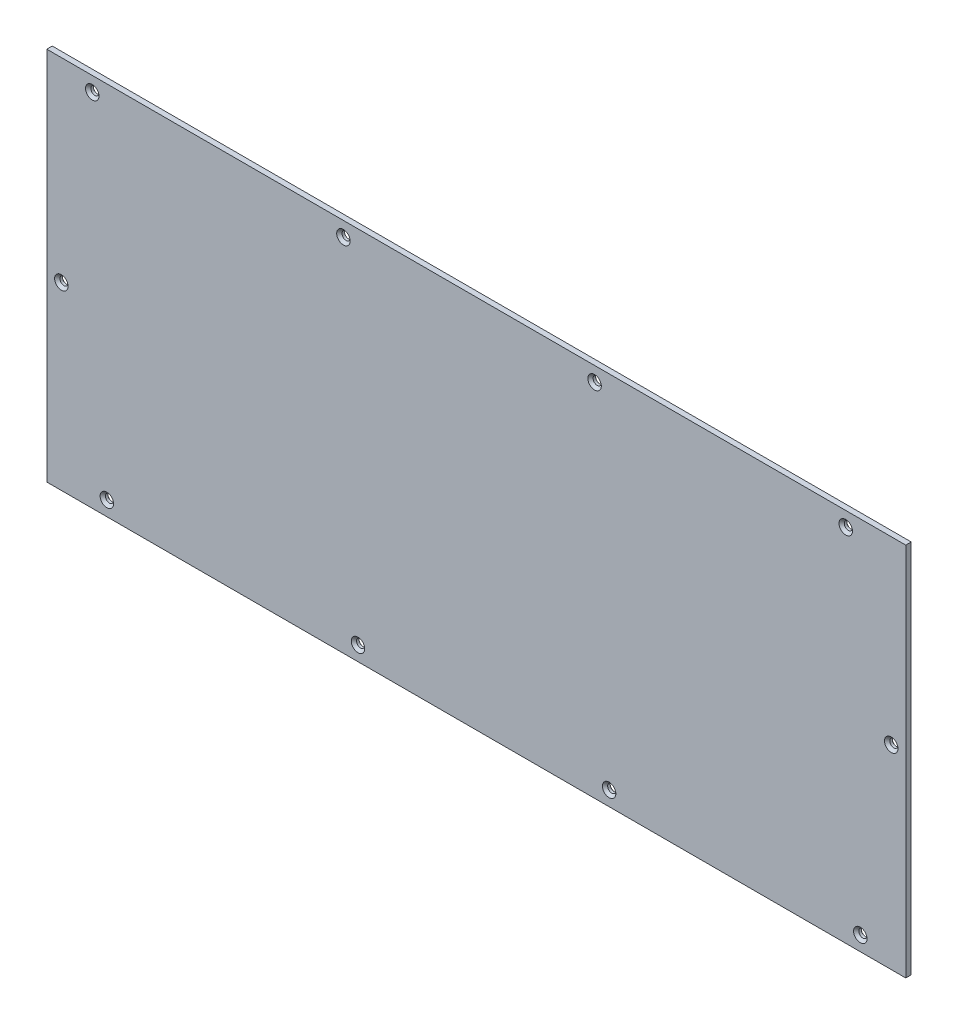
ISO-10303-21;
HEADER;
FILE_DESCRIPTION(('STEP AP214'),'2;1');
FILE_NAME('part.step','',(''),(''),'','','');
FILE_SCHEMA(('AUTOMOTIVE_DESIGN { 1 0 10303 214 1 1 1 1 }'));
ENDSEC;
DATA;
#1=APPLICATION_CONTEXT('core data for automotive mechanical design processes');
#2=APPLICATION_PROTOCOL_DEFINITION('international standard','automotive_design',2000,#1);
#3=PRODUCT_CONTEXT('',#1,'mechanical');
#4=PRODUCT('Part','Part','',(#3));
#5=PRODUCT_RELATED_PRODUCT_CATEGORY('part','',(#4));
#6=PRODUCT_DEFINITION_FORMATION('','',#4);
#7=PRODUCT_DEFINITION_CONTEXT('part definition',#1,'design');
#8=PRODUCT_DEFINITION('design','',#6,#7);
#9=PRODUCT_DEFINITION_SHAPE('','',#8);
#10=(LENGTH_UNIT() NAMED_UNIT(*) SI_UNIT(.MILLI.,.METRE.));
#11=(NAMED_UNIT(*) PLANE_ANGLE_UNIT() SI_UNIT($,.RADIAN.));
#12=(NAMED_UNIT(*) SI_UNIT($,.STERADIAN.) SOLID_ANGLE_UNIT());
#13=UNCERTAINTY_MEASURE_WITH_UNIT(LENGTH_MEASURE(1.E-05),#10,'distance_accuracy_value','');
#14=(GEOMETRIC_REPRESENTATION_CONTEXT(3) GLOBAL_UNCERTAINTY_ASSIGNED_CONTEXT((#13)) GLOBAL_UNIT_ASSIGNED_CONTEXT((#10,
#11,#12)) REPRESENTATION_CONTEXT('',''));
#15=CARTESIAN_POINT('',(0.,0.,0.));
#16=DIRECTION('',(0.,0.,1.));
#17=DIRECTION('',(1.,0.,0.));
#18=AXIS2_PLACEMENT_3D('',#15,#16,#17);
#19=CARTESIAN_POINT('',(0.,0.,3.));
#20=DIRECTION('',(1.,0.,0.));
#21=DIRECTION('',(0.,0.,-1.));
#22=AXIS2_PLACEMENT_3D('',#19,#20,#21);
#23=PLANE('',#22);
#24=DIRECTION('',(0.,-1.,0.));
#25=VECTOR('',#24,1.);
#26=CARTESIAN_POINT('',(0.,0.,0.));
#27=LINE('',#26,#25);
#28=CARTESIAN_POINT('',(0.,206.,0.));
#29=VERTEX_POINT('',#28);
#30=CARTESIAN_POINT('',(0.,0.,0.));
#31=VERTEX_POINT('',#30);
#32=EDGE_CURVE('E94',#29,#31,#27,.T.);
#33=ORIENTED_EDGE('',*,*,#32,.T.);
#34=DIRECTION('',(0.,0.,-1.));
#35=VECTOR('',#34,1.);
#36=CARTESIAN_POINT('',(0.,0.,3.));
#37=LINE('',#36,#35);
#38=CARTESIAN_POINT('',(0.,0.,3.));
#39=VERTEX_POINT('',#38);
#40=EDGE_CURVE('E11',#39,#31,#37,.T.);
#41=ORIENTED_EDGE('',*,*,#40,.F.);
#42=DIRECTION('',(0.,-1.,0.));
#43=VECTOR('',#42,1.);
#44=CARTESIAN_POINT('',(0.,0.,3.));
#45=LINE('',#44,#43);
#46=CARTESIAN_POINT('',(0.,206.,3.));
#47=VERTEX_POINT('',#46);
#48=EDGE_CURVE('E82',#47,#39,#45,.T.);
#49=ORIENTED_EDGE('',*,*,#48,.F.);
#50=DIRECTION('',(0.,0.,-1.));
#51=VECTOR('',#50,1.);
#52=CARTESIAN_POINT('',(0.,206.,3.));
#53=LINE('',#52,#51);
#54=EDGE_CURVE('E90',#47,#29,#53,.T.);
#55=ORIENTED_EDGE('',*,*,#54,.T.);
#56=EDGE_LOOP('',(#33,#41,#49,#55));
#57=FACE_BOUND('',#56,.T.);
#58=ADVANCED_FACE('F31',(#57),#23,.F.);
#59=CARTESIAN_POINT('',(0.,0.,3.));
#60=DIRECTION('',(0.,1.,0.));
#61=DIRECTION('',(0.,0.,1.));
#62=AXIS2_PLACEMENT_3D('',#59,#60,#61);
#63=PLANE('',#62);
#64=DIRECTION('',(1.,0.,0.));
#65=VECTOR('',#64,1.);
#66=CARTESIAN_POINT('',(0.,0.,0.));
#67=LINE('',#66,#65);
#68=CARTESIAN_POINT('',(472.,0.,0.));
#69=VERTEX_POINT('',#68);
#70=EDGE_CURVE('E86',#31,#69,#67,.T.);
#71=ORIENTED_EDGE('',*,*,#70,.T.);
#72=DIRECTION('',(0.,0.,-1.));
#73=VECTOR('',#72,1.);
#74=CARTESIAN_POINT('',(472.,0.,3.));
#75=LINE('',#74,#73);
#76=CARTESIAN_POINT('',(472.,0.,3.));
#77=VERTEX_POINT('',#76);
#78=EDGE_CURVE('E39',#77,#69,#75,.T.);
#79=ORIENTED_EDGE('',*,*,#78,.F.);
#80=DIRECTION('',(1.,0.,0.));
#81=VECTOR('',#80,1.);
#82=CARTESIAN_POINT('',(0.,0.,3.));
#83=LINE('',#82,#81);
#84=EDGE_CURVE('E77',#39,#77,#83,.T.);
#85=ORIENTED_EDGE('',*,*,#84,.F.);
#86=ORIENTED_EDGE('',*,*,#40,.T.);
#87=EDGE_LOOP('',(#71,#79,#85,#86));
#88=FACE_BOUND('',#87,.T.);
#89=ADVANCED_FACE('F85',(#88),#63,.F.);
#90=CARTESIAN_POINT('',(472.,0.,3.));
#91=DIRECTION('',(-1.,0.,0.));
#92=DIRECTION('',(0.,0.,1.));
#93=AXIS2_PLACEMENT_3D('',#90,#91,#92);
#94=PLANE('',#93);
#95=DIRECTION('',(0.,1.,0.));
#96=VECTOR('',#95,1.);
#97=CARTESIAN_POINT('',(472.,0.,0.));
#98=LINE('',#97,#96);
#99=CARTESIAN_POINT('',(472.,206.,0.));
#100=VERTEX_POINT('',#99);
#101=EDGE_CURVE('E64',#69,#100,#98,.T.);
#102=ORIENTED_EDGE('',*,*,#101,.T.);
#103=DIRECTION('',(0.,0.,-1.));
#104=VECTOR('',#103,1.);
#105=CARTESIAN_POINT('',(472.,206.,3.));
#106=LINE('',#105,#104);
#107=CARTESIAN_POINT('',(472.,206.,3.));
#108=VERTEX_POINT('',#107);
#109=EDGE_CURVE('E87',#108,#100,#106,.T.);
#110=ORIENTED_EDGE('',*,*,#109,.F.);
#111=DIRECTION('',(0.,1.,0.));
#112=VECTOR('',#111,1.);
#113=CARTESIAN_POINT('',(472.,0.,3.));
#114=LINE('',#113,#112);
#115=EDGE_CURVE('E80',#77,#108,#114,.T.);
#116=ORIENTED_EDGE('',*,*,#115,.F.);
#117=ORIENTED_EDGE('',*,*,#78,.T.);
#118=EDGE_LOOP('',(#102,#110,#116,#117));
#119=FACE_BOUND('',#118,.T.);
#120=ADVANCED_FACE('F88',(#119),#94,.F.);
#121=CARTESIAN_POINT('',(0.,206.,3.));
#122=DIRECTION('',(0.,-1.,0.));
#123=DIRECTION('',(0.,0.,-1.));
#124=AXIS2_PLACEMENT_3D('',#121,#122,#123);
#125=PLANE('',#124);
#126=DIRECTION('',(-1.,0.,0.));
#127=VECTOR('',#126,1.);
#128=CARTESIAN_POINT('',(0.,206.,0.));
#129=LINE('',#128,#127);
#130=EDGE_CURVE('E70',#100,#29,#129,.T.);
#131=ORIENTED_EDGE('',*,*,#130,.T.);
#132=ORIENTED_EDGE('',*,*,#54,.F.);
#133=DIRECTION('',(-1.,0.,0.));
#134=VECTOR('',#133,1.);
#135=CARTESIAN_POINT('',(0.,206.,3.));
#136=LINE('',#135,#134);
#137=EDGE_CURVE('E47',#108,#47,#136,.T.);
#138=ORIENTED_EDGE('',*,*,#137,.F.);
#139=ORIENTED_EDGE('',*,*,#109,.T.);
#140=EDGE_LOOP('',(#131,#132,#138,#139));
#141=FACE_BOUND('',#140,.T.);
#142=ADVANCED_FACE('F102',(#141),#125,.F.);
#143=CARTESIAN_POINT('',(0.,206.,3.));
#144=DIRECTION('',(0.,0.,-1.));
#145=DIRECTION('',(-1.,0.,0.));
#146=AXIS2_PLACEMENT_3D('',#143,#144,#145);
#147=PLANE('',#146);
#148=CARTESIAN_POINT('',(25.,198.,3.));
#149=DIRECTION('',(0.,0.,1.));
#150=DIRECTION('',(1.,0.,0.));
#151=AXIS2_PLACEMENT_3D('',#148,#149,#150);
#152=CIRCLE('',#151,3.7);
#153=CARTESIAN_POINT('',(28.7,198.,3.));
#154=VERTEX_POINT('',#153);
#155=EDGE_CURVE('E221',#154,#154,#152,.T.);
#156=ORIENTED_EDGE('',*,*,#155,.F.);
#157=EDGE_LOOP('',(#156));
#158=FACE_BOUND('',#157,.T.);
#159=CARTESIAN_POINT('',(163.,198.,3.));
#160=DIRECTION('',(0.,0.,1.));
#161=DIRECTION('',(1.,0.,0.));
#162=AXIS2_PLACEMENT_3D('',#159,#160,#161);
#163=CIRCLE('',#162,3.70000000000001);
#164=CARTESIAN_POINT('',(166.7,198.,3.));
#165=VERTEX_POINT('',#164);
#166=EDGE_CURVE('E209',#165,#165,#163,.T.);
#167=ORIENTED_EDGE('',*,*,#166,.F.);
#168=EDGE_LOOP('',(#167));
#169=FACE_BOUND('',#168,.T.);
#170=CARTESIAN_POINT('',(301.,198.,3.));
#171=DIRECTION('',(0.,0.,1.));
#172=DIRECTION('',(1.,0.,0.));
#173=AXIS2_PLACEMENT_3D('',#170,#171,#172);
#174=CIRCLE('',#173,3.69999999999998);
#175=CARTESIAN_POINT('',(304.7,198.,3.));
#176=VERTEX_POINT('',#175);
#177=EDGE_CURVE('E197',#176,#176,#174,.T.);
#178=ORIENTED_EDGE('',*,*,#177,.F.);
#179=EDGE_LOOP('',(#178));
#180=FACE_BOUND('',#179,.T.);
#181=CARTESIAN_POINT('',(439.,198.,3.));
#182=DIRECTION('',(0.,0.,1.));
#183=DIRECTION('',(1.,0.,0.));
#184=AXIS2_PLACEMENT_3D('',#181,#182,#183);
#185=CIRCLE('',#184,3.69999999999998);
#186=CARTESIAN_POINT('',(442.7,198.,3.));
#187=VERTEX_POINT('',#186);
#188=EDGE_CURVE('E185',#187,#187,#185,.T.);
#189=ORIENTED_EDGE('',*,*,#188,.F.);
#190=EDGE_LOOP('',(#189));
#191=FACE_BOUND('',#190,.T.);
#192=CARTESIAN_POINT('',(447.,8.,3.));
#193=DIRECTION('',(0.,0.,1.));
#194=DIRECTION('',(1.,0.,0.));
#195=AXIS2_PLACEMENT_3D('',#192,#193,#194);
#196=CIRCLE('',#195,3.69999999999998);
#197=CARTESIAN_POINT('',(450.7,8.,3.));
#198=VERTEX_POINT('',#197);
#199=EDGE_CURVE('E173',#198,#198,#196,.T.);
#200=ORIENTED_EDGE('',*,*,#199,.F.);
#201=EDGE_LOOP('',(#200));
#202=FACE_BOUND('',#201,.T.);
#203=CARTESIAN_POINT('',(309.,8.,3.));
#204=DIRECTION('',(0.,0.,1.));
#205=DIRECTION('',(1.,0.,0.));
#206=AXIS2_PLACEMENT_3D('',#203,#204,#205);
#207=CIRCLE('',#206,3.69999999999998);
#208=CARTESIAN_POINT('',(312.7,8.,3.));
#209=VERTEX_POINT('',#208);
#210=EDGE_CURVE('E161',#209,#209,#207,.T.);
#211=ORIENTED_EDGE('',*,*,#210,.F.);
#212=EDGE_LOOP('',(#211));
#213=FACE_BOUND('',#212,.T.);
#214=CARTESIAN_POINT('',(171.,8.,3.));
#215=DIRECTION('',(0.,0.,1.));
#216=DIRECTION('',(1.,0.,0.));
#217=AXIS2_PLACEMENT_3D('',#214,#215,#216);
#218=CIRCLE('',#217,3.70000000000001);
#219=CARTESIAN_POINT('',(174.7,8.,3.));
#220=VERTEX_POINT('',#219);
#221=EDGE_CURVE('E149',#220,#220,#218,.T.);
#222=ORIENTED_EDGE('',*,*,#221,.F.);
#223=EDGE_LOOP('',(#222));
#224=FACE_BOUND('',#223,.T.);
#225=CARTESIAN_POINT('',(33.,8.,3.));
#226=DIRECTION('',(0.,0.,1.));
#227=DIRECTION('',(1.,0.,0.));
#228=AXIS2_PLACEMENT_3D('',#225,#226,#227);
#229=CIRCLE('',#228,3.7);
#230=CARTESIAN_POINT('',(36.7,8.,3.));
#231=VERTEX_POINT('',#230);
#232=EDGE_CURVE('E137',#231,#231,#229,.T.);
#233=ORIENTED_EDGE('',*,*,#232,.F.);
#234=EDGE_LOOP('',(#233));
#235=FACE_BOUND('',#234,.T.);
#236=CARTESIAN_POINT('',(8.,99.,3.));
#237=DIRECTION('',(0.,0.,1.));
#238=DIRECTION('',(1.,0.,0.));
#239=AXIS2_PLACEMENT_3D('',#236,#237,#238);
#240=CIRCLE('',#239,3.7);
#241=CARTESIAN_POINT('',(11.7,99.,3.));
#242=VERTEX_POINT('',#241);
#243=EDGE_CURVE('E125',#242,#242,#240,.T.);
#244=ORIENTED_EDGE('',*,*,#243,.F.);
#245=EDGE_LOOP('',(#244));
#246=FACE_BOUND('',#245,.T.);
#247=CARTESIAN_POINT('',(464.,107.,3.));
#248=DIRECTION('',(0.,0.,1.));
#249=DIRECTION('',(1.,0.,0.));
#250=AXIS2_PLACEMENT_3D('',#247,#248,#249);
#251=CIRCLE('',#250,3.69999999999998);
#252=CARTESIAN_POINT('',(467.7,107.,3.));
#253=VERTEX_POINT('',#252);
#254=EDGE_CURVE('E113',#253,#253,#251,.T.);
#255=ORIENTED_EDGE('',*,*,#254,.F.);
#256=EDGE_LOOP('',(#255));
#257=FACE_BOUND('',#256,.T.);
#258=ORIENTED_EDGE('',*,*,#48,.T.);
#259=ORIENTED_EDGE('',*,*,#84,.T.);
#260=ORIENTED_EDGE('',*,*,#115,.T.);
#261=ORIENTED_EDGE('',*,*,#137,.T.);
#262=EDGE_LOOP('',(#258,#259,#260,#261));
#263=FACE_BOUND('',#262,.T.);
#264=ADVANCED_FACE('F78',(#158,#169,#180,#191,#202,#213,#224,#235,#246,#257,#263),#147,.F.);
#265=CARTESIAN_POINT('',(0.,206.,0.));
#266=DIRECTION('',(0.,0.,-1.));
#267=DIRECTION('',(-1.,0.,0.));
#268=AXIS2_PLACEMENT_3D('',#265,#266,#267);
#269=PLANE('',#268);
#270=CARTESIAN_POINT('',(25.,198.,0.));
#271=DIRECTION('',(0.,0.,1.));
#272=DIRECTION('',(1.,0.,0.));
#273=AXIS2_PLACEMENT_3D('',#270,#271,#272);
#274=CIRCLE('',#273,2.4);
#275=CARTESIAN_POINT('',(27.4,198.,0.));
#276=VERTEX_POINT('',#275);
#277=EDGE_CURVE('E224',#276,#276,#274,.T.);
#278=ORIENTED_EDGE('',*,*,#277,.T.);
#279=EDGE_LOOP('',(#278));
#280=FACE_BOUND('',#279,.T.);
#281=CARTESIAN_POINT('',(163.,198.,0.));
#282=DIRECTION('',(0.,0.,1.));
#283=DIRECTION('',(1.,0.,0.));
#284=AXIS2_PLACEMENT_3D('',#281,#282,#283);
#285=CIRCLE('',#284,2.40000000000001);
#286=CARTESIAN_POINT('',(165.4,198.,0.));
#287=VERTEX_POINT('',#286);
#288=EDGE_CURVE('E212',#287,#287,#285,.T.);
#289=ORIENTED_EDGE('',*,*,#288,.T.);
#290=EDGE_LOOP('',(#289));
#291=FACE_BOUND('',#290,.T.);
#292=CARTESIAN_POINT('',(301.,198.,0.));
#293=DIRECTION('',(0.,0.,1.));
#294=DIRECTION('',(1.,0.,0.));
#295=AXIS2_PLACEMENT_3D('',#292,#293,#294);
#296=CIRCLE('',#295,2.40000000000001);
#297=CARTESIAN_POINT('',(303.4,198.,0.));
#298=VERTEX_POINT('',#297);
#299=EDGE_CURVE('E200',#298,#298,#296,.T.);
#300=ORIENTED_EDGE('',*,*,#299,.T.);
#301=EDGE_LOOP('',(#300));
#302=FACE_BOUND('',#301,.T.);
#303=CARTESIAN_POINT('',(439.,198.,0.));
#304=DIRECTION('',(0.,0.,1.));
#305=DIRECTION('',(1.,0.,0.));
#306=AXIS2_PLACEMENT_3D('',#303,#304,#305);
#307=CIRCLE('',#306,2.40000000000001);
#308=CARTESIAN_POINT('',(441.4,198.,0.));
#309=VERTEX_POINT('',#308);
#310=EDGE_CURVE('E188',#309,#309,#307,.T.);
#311=ORIENTED_EDGE('',*,*,#310,.T.);
#312=EDGE_LOOP('',(#311));
#313=FACE_BOUND('',#312,.T.);
#314=CARTESIAN_POINT('',(447.,8.,0.));
#315=DIRECTION('',(0.,0.,1.));
#316=DIRECTION('',(1.,0.,0.));
#317=AXIS2_PLACEMENT_3D('',#314,#315,#316);
#318=CIRCLE('',#317,2.40000000000001);
#319=CARTESIAN_POINT('',(449.4,8.,0.));
#320=VERTEX_POINT('',#319);
#321=EDGE_CURVE('E176',#320,#320,#318,.T.);
#322=ORIENTED_EDGE('',*,*,#321,.T.);
#323=EDGE_LOOP('',(#322));
#324=FACE_BOUND('',#323,.T.);
#325=CARTESIAN_POINT('',(309.,8.,0.));
#326=DIRECTION('',(0.,0.,1.));
#327=DIRECTION('',(1.,0.,0.));
#328=AXIS2_PLACEMENT_3D('',#325,#326,#327);
#329=CIRCLE('',#328,2.40000000000001);
#330=CARTESIAN_POINT('',(311.4,8.,0.));
#331=VERTEX_POINT('',#330);
#332=EDGE_CURVE('E164',#331,#331,#329,.T.);
#333=ORIENTED_EDGE('',*,*,#332,.T.);
#334=EDGE_LOOP('',(#333));
#335=FACE_BOUND('',#334,.T.);
#336=CARTESIAN_POINT('',(171.,8.,0.));
#337=DIRECTION('',(0.,0.,1.));
#338=DIRECTION('',(1.,0.,0.));
#339=AXIS2_PLACEMENT_3D('',#336,#337,#338);
#340=CIRCLE('',#339,2.40000000000001);
#341=CARTESIAN_POINT('',(173.4,8.,0.));
#342=VERTEX_POINT('',#341);
#343=EDGE_CURVE('E152',#342,#342,#340,.T.);
#344=ORIENTED_EDGE('',*,*,#343,.T.);
#345=EDGE_LOOP('',(#344));
#346=FACE_BOUND('',#345,.T.);
#347=CARTESIAN_POINT('',(33.,8.,0.));
#348=DIRECTION('',(0.,0.,1.));
#349=DIRECTION('',(1.,0.,0.));
#350=AXIS2_PLACEMENT_3D('',#347,#348,#349);
#351=CIRCLE('',#350,2.4);
#352=CARTESIAN_POINT('',(35.4,8.,0.));
#353=VERTEX_POINT('',#352);
#354=EDGE_CURVE('E140',#353,#353,#351,.T.);
#355=ORIENTED_EDGE('',*,*,#354,.T.);
#356=EDGE_LOOP('',(#355));
#357=FACE_BOUND('',#356,.T.);
#358=CARTESIAN_POINT('',(8.,99.,0.));
#359=DIRECTION('',(0.,0.,1.));
#360=DIRECTION('',(1.,0.,0.));
#361=AXIS2_PLACEMENT_3D('',#358,#359,#360);
#362=CIRCLE('',#361,2.4);
#363=CARTESIAN_POINT('',(10.4,99.,0.));
#364=VERTEX_POINT('',#363);
#365=EDGE_CURVE('E128',#364,#364,#362,.T.);
#366=ORIENTED_EDGE('',*,*,#365,.T.);
#367=EDGE_LOOP('',(#366));
#368=FACE_BOUND('',#367,.T.);
#369=CARTESIAN_POINT('',(464.,107.,0.));
#370=DIRECTION('',(0.,0.,1.));
#371=DIRECTION('',(1.,0.,0.));
#372=AXIS2_PLACEMENT_3D('',#369,#370,#371);
#373=CIRCLE('',#372,2.40000000000001);
#374=CARTESIAN_POINT('',(466.4,107.,0.));
#375=VERTEX_POINT('',#374);
#376=EDGE_CURVE('E116',#375,#375,#373,.T.);
#377=ORIENTED_EDGE('',*,*,#376,.T.);
#378=EDGE_LOOP('',(#377));
#379=FACE_BOUND('',#378,.T.);
#380=ORIENTED_EDGE('',*,*,#32,.F.);
#381=ORIENTED_EDGE('',*,*,#130,.F.);
#382=ORIENTED_EDGE('',*,*,#101,.F.);
#383=ORIENTED_EDGE('',*,*,#70,.F.);
#384=EDGE_LOOP('',(#380,#381,#382,#383));
#385=FACE_BOUND('',#384,.T.);
#386=ADVANCED_FACE('F105',(#280,#291,#302,#313,#324,#335,#346,#357,#368,#379,#385),#269,.T.);
#387=CARTESIAN_POINT('',(464.,107.,0.150000000000002));
#388=DIRECTION('',(0.,0.,-1.));
#389=DIRECTION('',(-1.,0.,0.));
#390=AXIS2_PLACEMENT_3D('',#387,#388,#389);
#391=CONICAL_SURFACE('',#390,2.24999999999997,0.785398163397573);
#392=ORIENTED_EDGE('',*,*,#376,.F.);
#393=EDGE_LOOP('',(#392));
#394=FACE_BOUND('',#393,.T.);
#395=CARTESIAN_POINT('',(464.,107.,0.150000000000002));
#396=DIRECTION('',(0.,0.,1.));
#397=DIRECTION('',(1.,0.,0.));
#398=AXIS2_PLACEMENT_3D('',#395,#396,#397);
#399=CIRCLE('',#398,2.24999999999997);
#400=CARTESIAN_POINT('',(466.25,107.,0.150000000000002));
#401=VERTEX_POINT('',#400);
#402=EDGE_CURVE('E97',#401,#401,#399,.T.);
#403=ORIENTED_EDGE('',*,*,#402,.T.);
#404=EDGE_LOOP('',(#403));
#405=FACE_BOUND('',#404,.T.);
#406=ADVANCED_FACE('F283',(#394,#405),#391,.F.);
#407=CARTESIAN_POINT('',(464.,107.,3.));
#408=DIRECTION('',(0.,0.,1.));
#409=DIRECTION('',(1.,0.,0.));
#410=AXIS2_PLACEMENT_3D('',#407,#408,#409);
#411=CYLINDRICAL_SURFACE('',#410,2.24999999999997);
#412=ORIENTED_EDGE('',*,*,#402,.F.);
#413=EDGE_LOOP('',(#412));
#414=FACE_BOUND('',#413,.T.);
#415=CARTESIAN_POINT('',(464.,107.,1.55));
#416=DIRECTION('',(0.,0.,1.));
#417=DIRECTION('',(1.,0.,0.));
#418=AXIS2_PLACEMENT_3D('',#415,#416,#417);
#419=CIRCLE('',#418,2.24999999999997);
#420=CARTESIAN_POINT('',(466.25,107.,1.55));
#421=VERTEX_POINT('',#420);
#422=EDGE_CURVE('E110',#421,#421,#419,.T.);
#423=ORIENTED_EDGE('',*,*,#422,.T.);
#424=EDGE_LOOP('',(#423));
#425=FACE_BOUND('',#424,.T.);
#426=ADVANCED_FACE('F273',(#414,#425),#411,.F.);
#427=CARTESIAN_POINT('',(464.,107.,3.));
#428=DIRECTION('',(0.,0.,1.));
#429=DIRECTION('',(1.,0.,0.));
#430=AXIS2_PLACEMENT_3D('',#427,#428,#429);
#431=CONICAL_SURFACE('',#430,3.69999999999998,0.78539816339745);
#432=ORIENTED_EDGE('',*,*,#422,.F.);
#433=EDGE_LOOP('',(#432));
#434=FACE_BOUND('',#433,.T.);
#435=ORIENTED_EDGE('',*,*,#254,.T.);
#436=EDGE_LOOP('',(#435));
#437=FACE_BOUND('',#436,.T.);
#438=ADVANCED_FACE('F270',(#434,#437),#431,.F.);
#439=CARTESIAN_POINT('',(8.,99.,0.150000000000002));
#440=DIRECTION('',(0.,0.,-1.));
#441=DIRECTION('',(-1.,0.,0.));
#442=AXIS2_PLACEMENT_3D('',#439,#440,#441);
#443=CONICAL_SURFACE('',#442,2.25,0.785398163397445);
#444=ORIENTED_EDGE('',*,*,#365,.F.);
#445=EDGE_LOOP('',(#444));
#446=FACE_BOUND('',#445,.T.);
#447=CARTESIAN_POINT('',(8.,99.,0.150000000000002));
#448=DIRECTION('',(0.,0.,1.));
#449=DIRECTION('',(1.,0.,0.));
#450=AXIS2_PLACEMENT_3D('',#447,#448,#449);
#451=CIRCLE('',#450,2.25);
#452=CARTESIAN_POINT('',(10.25,99.,0.150000000000002));
#453=VERTEX_POINT('',#452);
#454=EDGE_CURVE('E119',#453,#453,#451,.T.);
#455=ORIENTED_EDGE('',*,*,#454,.T.);
#456=EDGE_LOOP('',(#455));
#457=FACE_BOUND('',#456,.T.);
#458=ADVANCED_FACE('F272',(#446,#457),#443,.F.);
#459=CARTESIAN_POINT('',(8.,99.,3.));
#460=DIRECTION('',(0.,0.,1.));
#461=DIRECTION('',(1.,0.,0.));
#462=AXIS2_PLACEMENT_3D('',#459,#460,#461);
#463=CYLINDRICAL_SURFACE('',#462,2.25);
#464=ORIENTED_EDGE('',*,*,#454,.F.);
#465=EDGE_LOOP('',(#464));
#466=FACE_BOUND('',#465,.T.);
#467=CARTESIAN_POINT('',(8.,99.,1.55));
#468=DIRECTION('',(0.,0.,1.));
#469=DIRECTION('',(1.,0.,0.));
#470=AXIS2_PLACEMENT_3D('',#467,#468,#469);
#471=CIRCLE('',#470,2.25);
#472=CARTESIAN_POINT('',(10.25,99.,1.55));
#473=VERTEX_POINT('',#472);
#474=EDGE_CURVE('E122',#473,#473,#471,.T.);
#475=ORIENTED_EDGE('',*,*,#474,.T.);
#476=EDGE_LOOP('',(#475));
#477=FACE_BOUND('',#476,.T.);
#478=ADVANCED_FACE('F280',(#466,#477),#463,.F.);
#479=CARTESIAN_POINT('',(8.,99.,3.));
#480=DIRECTION('',(0.,0.,1.));
#481=DIRECTION('',(1.,0.,0.));
#482=AXIS2_PLACEMENT_3D('',#479,#480,#481);
#483=CONICAL_SURFACE('',#482,3.7,0.785398163397447);
#484=ORIENTED_EDGE('',*,*,#474,.F.);
#485=EDGE_LOOP('',(#484));
#486=FACE_BOUND('',#485,.T.);
#487=ORIENTED_EDGE('',*,*,#243,.T.);
#488=EDGE_LOOP('',(#487));
#489=FACE_BOUND('',#488,.T.);
#490=ADVANCED_FACE('F334',(#486,#489),#483,.F.);
#491=CARTESIAN_POINT('',(33.,8.,0.150000000000002));
#492=DIRECTION('',(0.,0.,-1.));
#493=DIRECTION('',(-1.,0.,0.));
#494=AXIS2_PLACEMENT_3D('',#491,#492,#493);
#495=CONICAL_SURFACE('',#494,2.25,0.785398163397434);
#496=ORIENTED_EDGE('',*,*,#354,.F.);
#497=EDGE_LOOP('',(#496));
#498=FACE_BOUND('',#497,.T.);
#499=CARTESIAN_POINT('',(33.,8.,0.150000000000002));
#500=DIRECTION('',(0.,0.,1.));
#501=DIRECTION('',(1.,0.,0.));
#502=AXIS2_PLACEMENT_3D('',#499,#500,#501);
#503=CIRCLE('',#502,2.25);
#504=CARTESIAN_POINT('',(35.25,8.,0.150000000000002));
#505=VERTEX_POINT('',#504);
#506=EDGE_CURVE('E131',#505,#505,#503,.T.);
#507=ORIENTED_EDGE('',*,*,#506,.T.);
#508=EDGE_LOOP('',(#507));
#509=FACE_BOUND('',#508,.T.);
#510=ADVANCED_FACE('F344',(#498,#509),#495,.F.);
#511=CARTESIAN_POINT('',(33.,8.,3.));
#512=DIRECTION('',(0.,0.,1.));
#513=DIRECTION('',(1.,0.,0.));
#514=AXIS2_PLACEMENT_3D('',#511,#512,#513);
#515=CYLINDRICAL_SURFACE('',#514,2.25);
#516=ORIENTED_EDGE('',*,*,#506,.F.);
#517=EDGE_LOOP('',(#516));
#518=FACE_BOUND('',#517,.T.);
#519=CARTESIAN_POINT('',(33.,8.,1.55));
#520=DIRECTION('',(0.,0.,1.));
#521=DIRECTION('',(1.,0.,0.));
#522=AXIS2_PLACEMENT_3D('',#519,#520,#521);
#523=CIRCLE('',#522,2.25);
#524=CARTESIAN_POINT('',(35.25,8.,1.55));
#525=VERTEX_POINT('',#524);
#526=EDGE_CURVE('E134',#525,#525,#523,.T.);
#527=ORIENTED_EDGE('',*,*,#526,.T.);
#528=EDGE_LOOP('',(#527));
#529=FACE_BOUND('',#528,.T.);
#530=ADVANCED_FACE('F354',(#518,#529),#515,.F.);
#531=CARTESIAN_POINT('',(33.,8.,3.));
#532=DIRECTION('',(0.,0.,1.));
#533=DIRECTION('',(1.,0.,0.));
#534=AXIS2_PLACEMENT_3D('',#531,#532,#533);
#535=CONICAL_SURFACE('',#534,3.7,0.785398163397447);
#536=ORIENTED_EDGE('',*,*,#526,.F.);
#537=EDGE_LOOP('',(#536));
#538=FACE_BOUND('',#537,.T.);
#539=ORIENTED_EDGE('',*,*,#232,.T.);
#540=EDGE_LOOP('',(#539));
#541=FACE_BOUND('',#540,.T.);
#542=ADVANCED_FACE('F364',(#538,#541),#535,.F.);
#543=CARTESIAN_POINT('',(171.,8.,0.150000000000002));
#544=DIRECTION('',(0.,0.,-1.));
#545=DIRECTION('',(-1.,0.,0.));
#546=AXIS2_PLACEMENT_3D('',#543,#544,#545);
#547=CONICAL_SURFACE('',#546,2.25,0.78539816339748);
#548=ORIENTED_EDGE('',*,*,#343,.F.);
#549=EDGE_LOOP('',(#548));
#550=FACE_BOUND('',#549,.T.);
#551=CARTESIAN_POINT('',(171.,8.,0.150000000000002));
#552=DIRECTION('',(0.,0.,1.));
#553=DIRECTION('',(1.,0.,0.));
#554=AXIS2_PLACEMENT_3D('',#551,#552,#553);
#555=CIRCLE('',#554,2.25);
#556=CARTESIAN_POINT('',(173.25,8.,0.150000000000002));
#557=VERTEX_POINT('',#556);
#558=EDGE_CURVE('E143',#557,#557,#555,.T.);
#559=ORIENTED_EDGE('',*,*,#558,.T.);
#560=EDGE_LOOP('',(#559));
#561=FACE_BOUND('',#560,.T.);
#562=ADVANCED_FACE('F374',(#550,#561),#547,.F.);
#563=CARTESIAN_POINT('',(171.,8.,3.));
#564=DIRECTION('',(0.,0.,1.));
#565=DIRECTION('',(1.,0.,0.));
#566=AXIS2_PLACEMENT_3D('',#563,#564,#565);
#567=CYLINDRICAL_SURFACE('',#566,2.25);
#568=ORIENTED_EDGE('',*,*,#558,.F.);
#569=EDGE_LOOP('',(#568));
#570=FACE_BOUND('',#569,.T.);
#571=CARTESIAN_POINT('',(171.,8.,1.55));
#572=DIRECTION('',(0.,0.,1.));
#573=DIRECTION('',(1.,0.,0.));
#574=AXIS2_PLACEMENT_3D('',#571,#572,#573);
#575=CIRCLE('',#574,2.25);
#576=CARTESIAN_POINT('',(173.25,8.,1.55));
#577=VERTEX_POINT('',#576);
#578=EDGE_CURVE('E146',#577,#577,#575,.T.);
#579=ORIENTED_EDGE('',*,*,#578,.T.);
#580=EDGE_LOOP('',(#579));
#581=FACE_BOUND('',#580,.T.);
#582=ADVANCED_FACE('F384',(#570,#581),#567,.F.);
#583=CARTESIAN_POINT('',(171.,8.,3.));
#584=DIRECTION('',(0.,0.,1.));
#585=DIRECTION('',(1.,0.,0.));
#586=AXIS2_PLACEMENT_3D('',#583,#584,#585);
#587=CONICAL_SURFACE('',#586,3.70000000000001,0.78539816339745);
#588=ORIENTED_EDGE('',*,*,#578,.F.);
#589=EDGE_LOOP('',(#588));
#590=FACE_BOUND('',#589,.T.);
#591=ORIENTED_EDGE('',*,*,#221,.T.);
#592=EDGE_LOOP('',(#591));
#593=FACE_BOUND('',#592,.T.);
#594=ADVANCED_FACE('F394',(#590,#593),#587,.F.);
#595=CARTESIAN_POINT('',(309.,8.,0.150000000000002));
#596=DIRECTION('',(0.,0.,-1.));
#597=DIRECTION('',(-1.,0.,0.));
#598=AXIS2_PLACEMENT_3D('',#595,#596,#597);
#599=CONICAL_SURFACE('',#598,2.24999999999997,0.785398163397573);
#600=ORIENTED_EDGE('',*,*,#332,.F.);
#601=EDGE_LOOP('',(#600));
#602=FACE_BOUND('',#601,.T.);
#603=CARTESIAN_POINT('',(309.,8.,0.150000000000002));
#604=DIRECTION('',(0.,0.,1.));
#605=DIRECTION('',(1.,0.,0.));
#606=AXIS2_PLACEMENT_3D('',#603,#604,#605);
#607=CIRCLE('',#606,2.24999999999997);
#608=CARTESIAN_POINT('',(311.25,8.,0.150000000000002));
#609=VERTEX_POINT('',#608);
#610=EDGE_CURVE('E155',#609,#609,#607,.T.);
#611=ORIENTED_EDGE('',*,*,#610,.T.);
#612=EDGE_LOOP('',(#611));
#613=FACE_BOUND('',#612,.T.);
#614=ADVANCED_FACE('F404',(#602,#613),#599,.F.);
#615=CARTESIAN_POINT('',(309.,8.,3.));
#616=DIRECTION('',(0.,0.,1.));
#617=DIRECTION('',(1.,0.,0.));
#618=AXIS2_PLACEMENT_3D('',#615,#616,#617);
#619=CYLINDRICAL_SURFACE('',#618,2.24999999999997);
#620=ORIENTED_EDGE('',*,*,#610,.F.);
#621=EDGE_LOOP('',(#620));
#622=FACE_BOUND('',#621,.T.);
#623=CARTESIAN_POINT('',(309.,8.,1.55));
#624=DIRECTION('',(0.,0.,1.));
#625=DIRECTION('',(1.,0.,0.));
#626=AXIS2_PLACEMENT_3D('',#623,#624,#625);
#627=CIRCLE('',#626,2.24999999999997);
#628=CARTESIAN_POINT('',(311.25,8.,1.55));
#629=VERTEX_POINT('',#628);
#630=EDGE_CURVE('E158',#629,#629,#627,.T.);
#631=ORIENTED_EDGE('',*,*,#630,.T.);
#632=EDGE_LOOP('',(#631));
#633=FACE_BOUND('',#632,.T.);
#634=ADVANCED_FACE('F414',(#622,#633),#619,.F.);
#635=CARTESIAN_POINT('',(309.,8.,3.));
#636=DIRECTION('',(0.,0.,1.));
#637=DIRECTION('',(1.,0.,0.));
#638=AXIS2_PLACEMENT_3D('',#635,#636,#637);
#639=CONICAL_SURFACE('',#638,3.69999999999998,0.78539816339745);
#640=ORIENTED_EDGE('',*,*,#630,.F.);
#641=EDGE_LOOP('',(#640));
#642=FACE_BOUND('',#641,.T.);
#643=ORIENTED_EDGE('',*,*,#210,.T.);
#644=EDGE_LOOP('',(#643));
#645=FACE_BOUND('',#644,.T.);
#646=ADVANCED_FACE('F424',(#642,#645),#639,.F.);
#647=CARTESIAN_POINT('',(447.,8.,0.150000000000002));
#648=DIRECTION('',(0.,0.,-1.));
#649=DIRECTION('',(-1.,0.,0.));
#650=AXIS2_PLACEMENT_3D('',#647,#648,#649);
#651=CONICAL_SURFACE('',#650,2.24999999999997,0.785398163397573);
#652=ORIENTED_EDGE('',*,*,#321,.F.);
#653=EDGE_LOOP('',(#652));
#654=FACE_BOUND('',#653,.T.);
#655=CARTESIAN_POINT('',(447.,8.,0.150000000000002));
#656=DIRECTION('',(0.,0.,1.));
#657=DIRECTION('',(1.,0.,0.));
#658=AXIS2_PLACEMENT_3D('',#655,#656,#657);
#659=CIRCLE('',#658,2.24999999999997);
#660=CARTESIAN_POINT('',(449.25,8.,0.150000000000002));
#661=VERTEX_POINT('',#660);
#662=EDGE_CURVE('E167',#661,#661,#659,.T.);
#663=ORIENTED_EDGE('',*,*,#662,.T.);
#664=EDGE_LOOP('',(#663));
#665=FACE_BOUND('',#664,.T.);
#666=ADVANCED_FACE('F434',(#654,#665),#651,.F.);
#667=CARTESIAN_POINT('',(447.,8.,3.));
#668=DIRECTION('',(0.,0.,1.));
#669=DIRECTION('',(1.,0.,0.));
#670=AXIS2_PLACEMENT_3D('',#667,#668,#669);
#671=CYLINDRICAL_SURFACE('',#670,2.24999999999997);
#672=ORIENTED_EDGE('',*,*,#662,.F.);
#673=EDGE_LOOP('',(#672));
#674=FACE_BOUND('',#673,.T.);
#675=CARTESIAN_POINT('',(447.,8.,1.55));
#676=DIRECTION('',(0.,0.,1.));
#677=DIRECTION('',(1.,0.,0.));
#678=AXIS2_PLACEMENT_3D('',#675,#676,#677);
#679=CIRCLE('',#678,2.24999999999997);
#680=CARTESIAN_POINT('',(449.25,8.,1.55));
#681=VERTEX_POINT('',#680);
#682=EDGE_CURVE('E170',#681,#681,#679,.T.);
#683=ORIENTED_EDGE('',*,*,#682,.T.);
#684=EDGE_LOOP('',(#683));
#685=FACE_BOUND('',#684,.T.);
#686=ADVANCED_FACE('F444',(#674,#685),#671,.F.);
#687=CARTESIAN_POINT('',(447.,8.,3.));
#688=DIRECTION('',(0.,0.,1.));
#689=DIRECTION('',(1.,0.,0.));
#690=AXIS2_PLACEMENT_3D('',#687,#688,#689);
#691=CONICAL_SURFACE('',#690,3.69999999999998,0.78539816339745);
#692=ORIENTED_EDGE('',*,*,#682,.F.);
#693=EDGE_LOOP('',(#692));
#694=FACE_BOUND('',#693,.T.);
#695=ORIENTED_EDGE('',*,*,#199,.T.);
#696=EDGE_LOOP('',(#695));
#697=FACE_BOUND('',#696,.T.);
#698=ADVANCED_FACE('F454',(#694,#697),#691,.F.);
#699=CARTESIAN_POINT('',(439.,198.,0.150000000000002));
#700=DIRECTION('',(0.,0.,-1.));
#701=DIRECTION('',(-1.,0.,0.));
#702=AXIS2_PLACEMENT_3D('',#699,#700,#701);
#703=CONICAL_SURFACE('',#702,2.24999999999997,0.785398163397573);
#704=ORIENTED_EDGE('',*,*,#310,.F.);
#705=EDGE_LOOP('',(#704));
#706=FACE_BOUND('',#705,.T.);
#707=CARTESIAN_POINT('',(439.,198.,0.150000000000002));
#708=DIRECTION('',(0.,0.,1.));
#709=DIRECTION('',(1.,0.,0.));
#710=AXIS2_PLACEMENT_3D('',#707,#708,#709);
#711=CIRCLE('',#710,2.24999999999997);
#712=CARTESIAN_POINT('',(441.25,198.,0.150000000000002));
#713=VERTEX_POINT('',#712);
#714=EDGE_CURVE('E179',#713,#713,#711,.T.);
#715=ORIENTED_EDGE('',*,*,#714,.T.);
#716=EDGE_LOOP('',(#715));
#717=FACE_BOUND('',#716,.T.);
#718=ADVANCED_FACE('F464',(#706,#717),#703,.F.);
#719=CARTESIAN_POINT('',(439.,198.,3.));
#720=DIRECTION('',(0.,0.,1.));
#721=DIRECTION('',(1.,0.,0.));
#722=AXIS2_PLACEMENT_3D('',#719,#720,#721);
#723=CYLINDRICAL_SURFACE('',#722,2.24999999999997);
#724=ORIENTED_EDGE('',*,*,#714,.F.);
#725=EDGE_LOOP('',(#724));
#726=FACE_BOUND('',#725,.T.);
#727=CARTESIAN_POINT('',(439.,198.,1.55));
#728=DIRECTION('',(0.,0.,1.));
#729=DIRECTION('',(1.,0.,0.));
#730=AXIS2_PLACEMENT_3D('',#727,#728,#729);
#731=CIRCLE('',#730,2.24999999999997);
#732=CARTESIAN_POINT('',(441.25,198.,1.55));
#733=VERTEX_POINT('',#732);
#734=EDGE_CURVE('E182',#733,#733,#731,.T.);
#735=ORIENTED_EDGE('',*,*,#734,.T.);
#736=EDGE_LOOP('',(#735));
#737=FACE_BOUND('',#736,.T.);
#738=ADVANCED_FACE('F474',(#726,#737),#723,.F.);
#739=CARTESIAN_POINT('',(439.,198.,3.));
#740=DIRECTION('',(0.,0.,1.));
#741=DIRECTION('',(1.,0.,0.));
#742=AXIS2_PLACEMENT_3D('',#739,#740,#741);
#743=CONICAL_SURFACE('',#742,3.69999999999998,0.78539816339745);
#744=ORIENTED_EDGE('',*,*,#734,.F.);
#745=EDGE_LOOP('',(#744));
#746=FACE_BOUND('',#745,.T.);
#747=ORIENTED_EDGE('',*,*,#188,.T.);
#748=EDGE_LOOP('',(#747));
#749=FACE_BOUND('',#748,.T.);
#750=ADVANCED_FACE('F484',(#746,#749),#743,.F.);
#751=CARTESIAN_POINT('',(301.,198.,0.150000000000002));
#752=DIRECTION('',(0.,0.,-1.));
#753=DIRECTION('',(-1.,0.,0.));
#754=AXIS2_PLACEMENT_3D('',#751,#752,#753);
#755=CONICAL_SURFACE('',#754,2.24999999999997,0.785398163397573);
#756=ORIENTED_EDGE('',*,*,#299,.F.);
#757=EDGE_LOOP('',(#756));
#758=FACE_BOUND('',#757,.T.);
#759=CARTESIAN_POINT('',(301.,198.,0.150000000000002));
#760=DIRECTION('',(0.,0.,1.));
#761=DIRECTION('',(1.,0.,0.));
#762=AXIS2_PLACEMENT_3D('',#759,#760,#761);
#763=CIRCLE('',#762,2.24999999999997);
#764=CARTESIAN_POINT('',(303.25,198.,0.150000000000002));
#765=VERTEX_POINT('',#764);
#766=EDGE_CURVE('E191',#765,#765,#763,.T.);
#767=ORIENTED_EDGE('',*,*,#766,.T.);
#768=EDGE_LOOP('',(#767));
#769=FACE_BOUND('',#768,.T.);
#770=ADVANCED_FACE('F494',(#758,#769),#755,.F.);
#771=CARTESIAN_POINT('',(301.,198.,3.));
#772=DIRECTION('',(0.,0.,1.));
#773=DIRECTION('',(1.,0.,0.));
#774=AXIS2_PLACEMENT_3D('',#771,#772,#773);
#775=CYLINDRICAL_SURFACE('',#774,2.24999999999997);
#776=ORIENTED_EDGE('',*,*,#766,.F.);
#777=EDGE_LOOP('',(#776));
#778=FACE_BOUND('',#777,.T.);
#779=CARTESIAN_POINT('',(301.,198.,1.55));
#780=DIRECTION('',(0.,0.,1.));
#781=DIRECTION('',(1.,0.,0.));
#782=AXIS2_PLACEMENT_3D('',#779,#780,#781);
#783=CIRCLE('',#782,2.24999999999997);
#784=CARTESIAN_POINT('',(303.25,198.,1.55));
#785=VERTEX_POINT('',#784);
#786=EDGE_CURVE('E194',#785,#785,#783,.T.);
#787=ORIENTED_EDGE('',*,*,#786,.T.);
#788=EDGE_LOOP('',(#787));
#789=FACE_BOUND('',#788,.T.);
#790=ADVANCED_FACE('F504',(#778,#789),#775,.F.);
#791=CARTESIAN_POINT('',(301.,198.,3.));
#792=DIRECTION('',(0.,0.,1.));
#793=DIRECTION('',(1.,0.,0.));
#794=AXIS2_PLACEMENT_3D('',#791,#792,#793);
#795=CONICAL_SURFACE('',#794,3.69999999999998,0.78539816339745);
#796=ORIENTED_EDGE('',*,*,#786,.F.);
#797=EDGE_LOOP('',(#796));
#798=FACE_BOUND('',#797,.T.);
#799=ORIENTED_EDGE('',*,*,#177,.T.);
#800=EDGE_LOOP('',(#799));
#801=FACE_BOUND('',#800,.T.);
#802=ADVANCED_FACE('F514',(#798,#801),#795,.F.);
#803=CARTESIAN_POINT('',(163.,198.,0.150000000000002));
#804=DIRECTION('',(0.,0.,-1.));
#805=DIRECTION('',(-1.,0.,0.));
#806=AXIS2_PLACEMENT_3D('',#803,#804,#805);
#807=CONICAL_SURFACE('',#806,2.25,0.78539816339748);
#808=ORIENTED_EDGE('',*,*,#288,.F.);
#809=EDGE_LOOP('',(#808));
#810=FACE_BOUND('',#809,.T.);
#811=CARTESIAN_POINT('',(163.,198.,0.150000000000002));
#812=DIRECTION('',(0.,0.,1.));
#813=DIRECTION('',(1.,0.,0.));
#814=AXIS2_PLACEMENT_3D('',#811,#812,#813);
#815=CIRCLE('',#814,2.25);
#816=CARTESIAN_POINT('',(165.25,198.,0.150000000000002));
#817=VERTEX_POINT('',#816);
#818=EDGE_CURVE('E203',#817,#817,#815,.T.);
#819=ORIENTED_EDGE('',*,*,#818,.T.);
#820=EDGE_LOOP('',(#819));
#821=FACE_BOUND('',#820,.T.);
#822=ADVANCED_FACE('F524',(#810,#821),#807,.F.);
#823=CARTESIAN_POINT('',(163.,198.,3.));
#824=DIRECTION('',(0.,0.,1.));
#825=DIRECTION('',(1.,0.,0.));
#826=AXIS2_PLACEMENT_3D('',#823,#824,#825);
#827=CYLINDRICAL_SURFACE('',#826,2.25);
#828=ORIENTED_EDGE('',*,*,#818,.F.);
#829=EDGE_LOOP('',(#828));
#830=FACE_BOUND('',#829,.T.);
#831=CARTESIAN_POINT('',(163.,198.,1.55));
#832=DIRECTION('',(0.,0.,1.));
#833=DIRECTION('',(1.,0.,0.));
#834=AXIS2_PLACEMENT_3D('',#831,#832,#833);
#835=CIRCLE('',#834,2.25);
#836=CARTESIAN_POINT('',(165.25,198.,1.55));
#837=VERTEX_POINT('',#836);
#838=EDGE_CURVE('E206',#837,#837,#835,.T.);
#839=ORIENTED_EDGE('',*,*,#838,.T.);
#840=EDGE_LOOP('',(#839));
#841=FACE_BOUND('',#840,.T.);
#842=ADVANCED_FACE('F534',(#830,#841),#827,.F.);
#843=CARTESIAN_POINT('',(163.,198.,3.));
#844=DIRECTION('',(0.,0.,1.));
#845=DIRECTION('',(1.,0.,0.));
#846=AXIS2_PLACEMENT_3D('',#843,#844,#845);
#847=CONICAL_SURFACE('',#846,3.70000000000001,0.78539816339745);
#848=ORIENTED_EDGE('',*,*,#838,.F.);
#849=EDGE_LOOP('',(#848));
#850=FACE_BOUND('',#849,.T.);
#851=ORIENTED_EDGE('',*,*,#166,.T.);
#852=EDGE_LOOP('',(#851));
#853=FACE_BOUND('',#852,.T.);
#854=ADVANCED_FACE('F234',(#850,#853),#847,.F.);
#855=CARTESIAN_POINT('',(25.,198.,0.150000000000002));
#856=DIRECTION('',(0.,0.,-1.));
#857=DIRECTION('',(-1.,0.,0.));
#858=AXIS2_PLACEMENT_3D('',#855,#856,#857);
#859=CONICAL_SURFACE('',#858,2.25,0.785398163397445);
#860=ORIENTED_EDGE('',*,*,#277,.F.);
#861=EDGE_LOOP('',(#860));
#862=FACE_BOUND('',#861,.T.);
#863=CARTESIAN_POINT('',(25.,198.,0.150000000000002));
#864=DIRECTION('',(0.,0.,1.));
#865=DIRECTION('',(1.,0.,0.));
#866=AXIS2_PLACEMENT_3D('',#863,#864,#865);
#867=CIRCLE('',#866,2.25);
#868=CARTESIAN_POINT('',(27.25,198.,0.150000000000002));
#869=VERTEX_POINT('',#868);
#870=EDGE_CURVE('E215',#869,#869,#867,.T.);
#871=ORIENTED_EDGE('',*,*,#870,.T.);
#872=EDGE_LOOP('',(#871));
#873=FACE_BOUND('',#872,.T.);
#874=ADVANCED_FACE('F230',(#862,#873),#859,.F.);
#875=CARTESIAN_POINT('',(25.,198.,3.));
#876=DIRECTION('',(0.,0.,1.));
#877=DIRECTION('',(1.,0.,0.));
#878=AXIS2_PLACEMENT_3D('',#875,#876,#877);
#879=CYLINDRICAL_SURFACE('',#878,2.25);
#880=ORIENTED_EDGE('',*,*,#870,.F.);
#881=EDGE_LOOP('',(#880));
#882=FACE_BOUND('',#881,.T.);
#883=CARTESIAN_POINT('',(25.,198.,1.55));
#884=DIRECTION('',(0.,0.,1.));
#885=DIRECTION('',(1.,0.,0.));
#886=AXIS2_PLACEMENT_3D('',#883,#884,#885);
#887=CIRCLE('',#886,2.25);
#888=CARTESIAN_POINT('',(27.25,198.,1.55));
#889=VERTEX_POINT('',#888);
#890=EDGE_CURVE('E218',#889,#889,#887,.T.);
#891=ORIENTED_EDGE('',*,*,#890,.T.);
#892=EDGE_LOOP('',(#891));
#893=FACE_BOUND('',#892,.T.);
#894=ADVANCED_FACE('F233',(#882,#893),#879,.F.);
#895=CARTESIAN_POINT('',(25.,198.,3.));
#896=DIRECTION('',(0.,0.,1.));
#897=DIRECTION('',(1.,0.,0.));
#898=AXIS2_PLACEMENT_3D('',#895,#896,#897);
#899=CONICAL_SURFACE('',#898,3.7,0.785398163397449);
#900=ORIENTED_EDGE('',*,*,#890,.F.);
#901=EDGE_LOOP('',(#900));
#902=FACE_BOUND('',#901,.T.);
#903=ORIENTED_EDGE('',*,*,#155,.T.);
#904=EDGE_LOOP('',(#903));
#905=FACE_BOUND('',#904,.T.);
#906=ADVANCED_FACE('F240',(#902,#905),#899,.F.);
#907=CLOSED_SHELL('',(#58,#89,#120,#142,#264,#386,#406,#426,#438,#458,#478,#490,#510,#530,#542,
#562,#582,#594,#614,#634,#646,#666,#686,#698,#718,#738,#750,#770,#790,#802,#822,#842,#854,#874,
#894,#906));
#908=MANIFOLD_SOLID_BREP('B2',#907);
#909=ADVANCED_BREP_SHAPE_REPRESENTATION('',(#18,#908),#14);
#910=SHAPE_DEFINITION_REPRESENTATION(#9,#909);
ENDSEC;
END-ISO-10303-21;
